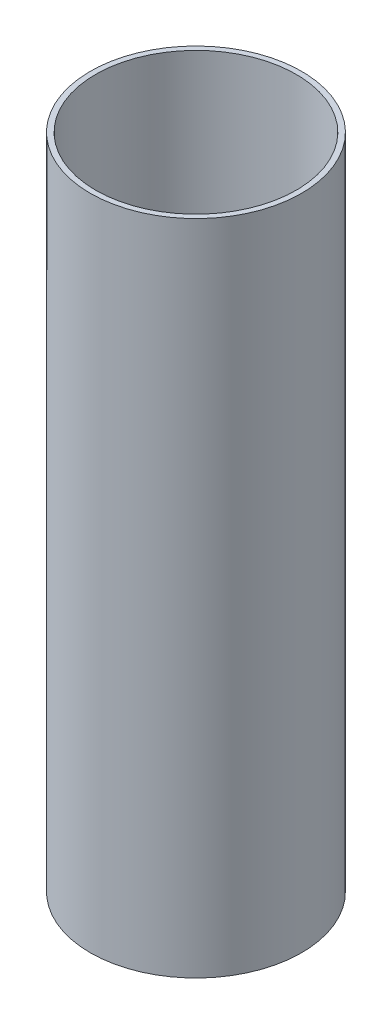
ISO-10303-21;
HEADER;
FILE_DESCRIPTION(('STEP AP214'),'2;1');
FILE_NAME('part.step','',(''),(''),'','','');
FILE_SCHEMA(('AUTOMOTIVE_DESIGN { 1 0 10303 214 1 1 1 1 }'));
ENDSEC;
DATA;
#1=APPLICATION_CONTEXT('core data for automotive mechanical design processes');
#2=APPLICATION_PROTOCOL_DEFINITION('international standard','automotive_design',2000,#1);
#3=PRODUCT_CONTEXT('',#1,'mechanical');
#4=PRODUCT('Part','Part','',(#3));
#5=PRODUCT_RELATED_PRODUCT_CATEGORY('part','',(#4));
#6=PRODUCT_DEFINITION_FORMATION('','',#4);
#7=PRODUCT_DEFINITION_CONTEXT('part definition',#1,'design');
#8=PRODUCT_DEFINITION('design','',#6,#7);
#9=PRODUCT_DEFINITION_SHAPE('','',#8);
#10=(LENGTH_UNIT() NAMED_UNIT(*) SI_UNIT(.MILLI.,.METRE.));
#11=(NAMED_UNIT(*) PLANE_ANGLE_UNIT() SI_UNIT($,.RADIAN.));
#12=(NAMED_UNIT(*) SI_UNIT($,.STERADIAN.) SOLID_ANGLE_UNIT());
#13=UNCERTAINTY_MEASURE_WITH_UNIT(LENGTH_MEASURE(1.E-05),#10,'distance_accuracy_value','');
#14=(GEOMETRIC_REPRESENTATION_CONTEXT(3) GLOBAL_UNCERTAINTY_ASSIGNED_CONTEXT((#13)) GLOBAL_UNIT_ASSIGNED_CONTEXT((#10,
#11,#12)) REPRESENTATION_CONTEXT('',''));
#15=CARTESIAN_POINT('',(0.,0.,0.));
#16=DIRECTION('',(0.,0.,1.));
#17=DIRECTION('',(1.,0.,0.));
#18=AXIS2_PLACEMENT_3D('',#15,#16,#17);
#19=CARTESIAN_POINT('',(0.,200.025,0.));
#20=DIRECTION('',(0.,1.,0.));
#21=DIRECTION('',(0.,0.,1.));
#22=AXIS2_PLACEMENT_3D('',#19,#20,#21);
#23=PLANE('',#22);
#24=CARTESIAN_POINT('',(0.,200.025,0.));
#25=DIRECTION('',(0.,1.,0.));
#26=DIRECTION('',(0.,0.,1.));
#27=AXIS2_PLACEMENT_3D('',#24,#25,#26);
#28=CIRCLE('',#27,32.1437);
#29=CARTESIAN_POINT('',(0.,200.025,32.1437));
#30=VERTEX_POINT('',#29);
#31=EDGE_CURVE('E10',#30,#30,#28,.T.);
#32=ORIENTED_EDGE('',*,*,#31,.T.);
#33=EDGE_LOOP('',(#32));
#34=FACE_BOUND('',#33,.T.);
#35=CARTESIAN_POINT('',(0.,200.025,0.));
#36=DIRECTION('',(0.,1.,0.));
#37=DIRECTION('',(0.,0.,1.));
#38=AXIS2_PLACEMENT_3D('',#35,#36,#37);
#39=CIRCLE('',#38,30.5181);
#40=CARTESIAN_POINT('',(0.,200.025,30.5181));
#41=VERTEX_POINT('',#40);
#42=EDGE_CURVE('E42',#41,#41,#39,.T.);
#43=ORIENTED_EDGE('',*,*,#42,.F.);
#44=EDGE_LOOP('',(#43));
#45=FACE_BOUND('',#44,.T.);
#46=ADVANCED_FACE('F31',(#34,#45),#23,.T.);
#47=CARTESIAN_POINT('',(0.,0.,0.));
#48=DIRECTION('',(0.,1.,0.));
#49=DIRECTION('',(0.,0.,1.));
#50=AXIS2_PLACEMENT_3D('',#47,#48,#49);
#51=PLANE('',#50);
#52=CARTESIAN_POINT('',(0.,0.,0.));
#53=DIRECTION('',(0.,1.,0.));
#54=DIRECTION('',(0.,0.,1.));
#55=AXIS2_PLACEMENT_3D('',#52,#53,#54);
#56=CIRCLE('',#55,32.1437);
#57=CARTESIAN_POINT('',(0.,0.,32.1437));
#58=VERTEX_POINT('',#57);
#59=EDGE_CURVE('E35',#58,#58,#56,.T.);
#60=ORIENTED_EDGE('',*,*,#59,.F.);
#61=EDGE_LOOP('',(#60));
#62=FACE_BOUND('',#61,.T.);
#63=CARTESIAN_POINT('',(0.,0.,0.));
#64=DIRECTION('',(0.,1.,0.));
#65=DIRECTION('',(0.,0.,1.));
#66=AXIS2_PLACEMENT_3D('',#63,#64,#65);
#67=CIRCLE('',#66,30.5181);
#68=CARTESIAN_POINT('',(0.,0.,30.5181));
#69=VERTEX_POINT('',#68);
#70=EDGE_CURVE('E44',#69,#69,#67,.T.);
#71=ORIENTED_EDGE('',*,*,#70,.T.);
#72=EDGE_LOOP('',(#71));
#73=FACE_BOUND('',#72,.T.);
#74=ADVANCED_FACE('F54',(#62,#73),#51,.F.);
#75=CARTESIAN_POINT('',(0.,200.025,0.));
#76=DIRECTION('',(0.,-1.,0.));
#77=DIRECTION('',(0.,0.,-1.));
#78=AXIS2_PLACEMENT_3D('',#75,#76,#77);
#79=CYLINDRICAL_SURFACE('',#78,32.1437);
#80=ORIENTED_EDGE('',*,*,#31,.F.);
#81=EDGE_LOOP('',(#80));
#82=FACE_BOUND('',#81,.T.);
#83=ORIENTED_EDGE('',*,*,#59,.T.);
#84=EDGE_LOOP('',(#83));
#85=FACE_BOUND('',#84,.T.);
#86=ADVANCED_FACE('F33',(#82,#85),#79,.T.);
#87=CARTESIAN_POINT('',(0.,200.025,0.));
#88=DIRECTION('',(0.,-1.,0.));
#89=DIRECTION('',(0.,0.,-1.));
#90=AXIS2_PLACEMENT_3D('',#87,#88,#89);
#91=CYLINDRICAL_SURFACE('',#90,30.5181);
#92=ORIENTED_EDGE('',*,*,#42,.T.);
#93=EDGE_LOOP('',(#92));
#94=FACE_BOUND('',#93,.T.);
#95=ORIENTED_EDGE('',*,*,#70,.F.);
#96=EDGE_LOOP('',(#95));
#97=FACE_BOUND('',#96,.T.);
#98=ADVANCED_FACE('F50',(#94,#97),#91,.F.);
#99=CLOSED_SHELL('',(#46,#74,#86,#98));
#100=MANIFOLD_SOLID_BREP('B2',#99);
#101=ADVANCED_BREP_SHAPE_REPRESENTATION('',(#18,#100),#14);
#102=SHAPE_DEFINITION_REPRESENTATION(#9,#101);
ENDSEC;
END-ISO-10303-21;
